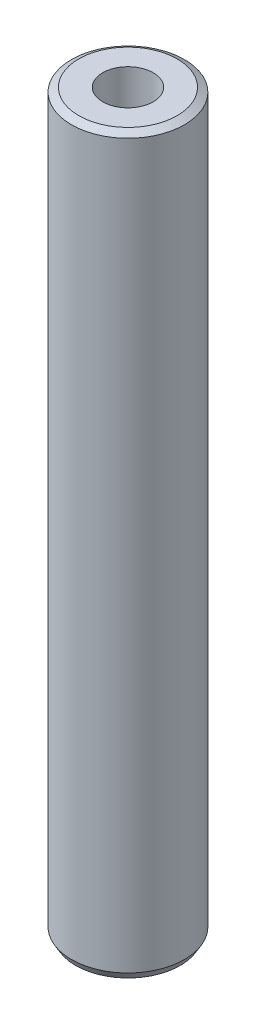
ISO-10303-21;
HEADER;
FILE_DESCRIPTION(('STEP AP214'),'2;1');
FILE_NAME('part.step','',(''),(''),'','','');
FILE_SCHEMA(('AUTOMOTIVE_DESIGN { 1 0 10303 214 1 1 1 1 }'));
ENDSEC;
DATA;
#1=APPLICATION_CONTEXT('core data for automotive mechanical design processes');
#2=APPLICATION_PROTOCOL_DEFINITION('international standard','automotive_design',2000,#1);
#3=PRODUCT_CONTEXT('',#1,'mechanical');
#4=PRODUCT('Part','Part','',(#3));
#5=PRODUCT_RELATED_PRODUCT_CATEGORY('part','',(#4));
#6=PRODUCT_DEFINITION_FORMATION('','',#4);
#7=PRODUCT_DEFINITION_CONTEXT('part definition',#1,'design');
#8=PRODUCT_DEFINITION('design','',#6,#7);
#9=PRODUCT_DEFINITION_SHAPE('','',#8);
#10=(LENGTH_UNIT() NAMED_UNIT(*) SI_UNIT(.MILLI.,.METRE.));
#11=(NAMED_UNIT(*) PLANE_ANGLE_UNIT() SI_UNIT($,.RADIAN.));
#12=(NAMED_UNIT(*) SI_UNIT($,.STERADIAN.) SOLID_ANGLE_UNIT());
#13=UNCERTAINTY_MEASURE_WITH_UNIT(LENGTH_MEASURE(1.E-05),#10,'distance_accuracy_value','');
#14=(GEOMETRIC_REPRESENTATION_CONTEXT(3) GLOBAL_UNCERTAINTY_ASSIGNED_CONTEXT((#13)) GLOBAL_UNIT_ASSIGNED_CONTEXT((#10,
#11,#12)) REPRESENTATION_CONTEXT('',''));
#15=CARTESIAN_POINT('',(0.,0.,0.));
#16=DIRECTION('',(0.,0.,1.));
#17=DIRECTION('',(1.,0.,0.));
#18=AXIS2_PLACEMENT_3D('',#15,#16,#17);
#19=CARTESIAN_POINT('',(0.,519.770944624068,0.));
#20=DIRECTION('',(0.,-1.,0.));
#21=DIRECTION('',(0.,0.,-1.));
#22=AXIS2_PLACEMENT_3D('',#19,#20,#21);
#23=CYLINDRICAL_SURFACE('',#22,40.);
#24=CARTESIAN_POINT('',(0.,516.782047485106,0.));
#25=DIRECTION('',(0.,1.,0.));
#26=DIRECTION('',(0.,0.,1.));
#27=AXIS2_PLACEMENT_3D('',#24,#25,#26);
#28=CIRCLE('',#27,40.);
#29=CARTESIAN_POINT('',(0.,516.782047485106,40.));
#30=VERTEX_POINT('',#29);
#31=EDGE_CURVE('E50',#30,#30,#28,.F.);
#32=ORIENTED_EDGE('',*,*,#31,.T.);
#33=EDGE_LOOP('',(#32));
#34=FACE_BOUND('',#33,.T.);
#35=CARTESIAN_POINT('',(0.,5.17692170328021,0.));
#36=DIRECTION('',(0.,1.,0.));
#37=DIRECTION('',(0.,0.,1.));
#38=AXIS2_PLACEMENT_3D('',#35,#36,#37);
#39=CIRCLE('',#38,40.);
#40=CARTESIAN_POINT('',(0.,5.17692170328021,40.));
#41=VERTEX_POINT('',#40);
#42=EDGE_CURVE('E51',#41,#41,#39,.T.);
#43=ORIENTED_EDGE('',*,*,#42,.T.);
#44=EDGE_LOOP('',(#43));
#45=FACE_BOUND('',#44,.T.);
#46=ADVANCED_FACE('F39',(#34,#45),#23,.T.);
#47=CARTESIAN_POINT('',(0.,519.770944624068,0.));
#48=DIRECTION('',(0.,1.,0.));
#49=DIRECTION('',(0.,0.,1.));
#50=AXIS2_PLACEMENT_3D('',#47,#48,#49);
#51=PLANE('',#50);
#52=CARTESIAN_POINT('',(0.,519.770944624068,0.));
#53=DIRECTION('',(0.,1.,0.));
#54=DIRECTION('',(0.,0.,1.));
#55=AXIS2_PLACEMENT_3D('',#52,#53,#54);
#56=CIRCLE('',#55,34.8230782967197);
#57=CARTESIAN_POINT('',(0.,519.770944624068,34.8230782967197));
#58=VERTEX_POINT('',#57);
#59=EDGE_CURVE('E54',#58,#58,#56,.T.);
#60=ORIENTED_EDGE('',*,*,#59,.T.);
#61=EDGE_LOOP('',(#60));
#62=FACE_BOUND('',#61,.T.);
#63=CARTESIAN_POINT('',(0.,519.770944624068,0.));
#64=DIRECTION('',(0.,1.,0.));
#65=DIRECTION('',(0.,0.,1.));
#66=AXIS2_PLACEMENT_3D('',#63,#64,#65);
#67=CIRCLE('',#66,17.8575470488768);
#68=CARTESIAN_POINT('',(0.,519.770944624068,17.8575470488768));
#69=VERTEX_POINT('',#68);
#70=EDGE_CURVE('E58',#69,#69,#67,.T.);
#71=ORIENTED_EDGE('',*,*,#70,.F.);
#72=EDGE_LOOP('',(#71));
#73=FACE_BOUND('',#72,.T.);
#74=ADVANCED_FACE('F69',(#62,#73),#51,.T.);
#75=CARTESIAN_POINT('',(0.,0.,0.));
#76=DIRECTION('',(0.,1.,0.));
#77=DIRECTION('',(0.,0.,1.));
#78=AXIS2_PLACEMENT_3D('',#75,#76,#77);
#79=PLANE('',#78);
#80=CARTESIAN_POINT('',(0.,0.,0.));
#81=DIRECTION('',(0.,1.,0.));
#82=DIRECTION('',(0.,0.,1.));
#83=AXIS2_PLACEMENT_3D('',#80,#81,#82);
#84=CIRCLE('',#83,37.0111028610375);
#85=CARTESIAN_POINT('',(0.,0.,37.0111028610375));
#86=VERTEX_POINT('',#85);
#87=EDGE_CURVE('E10',#86,#86,#84,.F.);
#88=ORIENTED_EDGE('',*,*,#87,.T.);
#89=EDGE_LOOP('',(#88));
#90=FACE_BOUND('',#89,.T.);
#91=CARTESIAN_POINT('',(0.,0.,0.));
#92=DIRECTION('',(0.,1.,0.));
#93=DIRECTION('',(0.,0.,1.));
#94=AXIS2_PLACEMENT_3D('',#91,#92,#93);
#95=CIRCLE('',#94,17.8575470488768);
#96=CARTESIAN_POINT('',(0.,0.,17.8575470488768));
#97=VERTEX_POINT('',#96);
#98=EDGE_CURVE('E63',#97,#97,#95,.T.);
#99=ORIENTED_EDGE('',*,*,#98,.T.);
#100=EDGE_LOOP('',(#99));
#101=FACE_BOUND('',#100,.T.);
#102=ADVANCED_FACE('F75',(#90,#101),#79,.F.);
#103=CARTESIAN_POINT('',(0.,519.770944624068,0.));
#104=DIRECTION('',(0.,-1.,0.));
#105=DIRECTION('',(0.,0.,-1.));
#106=AXIS2_PLACEMENT_3D('',#103,#104,#105);
#107=CYLINDRICAL_SURFACE('',#106,17.8575470488768);
#108=ORIENTED_EDGE('',*,*,#70,.T.);
#109=EDGE_LOOP('',(#108));
#110=FACE_BOUND('',#109,.T.);
#111=ORIENTED_EDGE('',*,*,#98,.F.);
#112=EDGE_LOOP('',(#111));
#113=FACE_BOUND('',#112,.T.);
#114=ADVANCED_FACE('F70',(#110,#113),#107,.F.);
#115=CARTESIAN_POINT('',(0.,519.770944624068,0.));
#116=DIRECTION('',(0.,-1.,0.));
#117=DIRECTION('',(0.,0.,-1.));
#118=AXIS2_PLACEMENT_3D('',#115,#116,#117);
#119=CONICAL_SURFACE('',#118,34.8230782967197,1.04719755119659);
#120=ORIENTED_EDGE('',*,*,#31,.F.);
#121=EDGE_LOOP('',(#120));
#122=FACE_BOUND('',#121,.T.);
#123=ORIENTED_EDGE('',*,*,#59,.F.);
#124=EDGE_LOOP('',(#123));
#125=FACE_BOUND('',#124,.T.);
#126=ADVANCED_FACE('F81',(#122,#125),#119,.T.);
#127=CARTESIAN_POINT('',(0.,5.17692170328021,0.));
#128=DIRECTION('',(0.,1.,0.));
#129=DIRECTION('',(0.,0.,1.));
#130=AXIS2_PLACEMENT_3D('',#127,#128,#129);
#131=CONICAL_SURFACE('',#130,40.,0.523598775598301);
#132=ORIENTED_EDGE('',*,*,#87,.F.);
#133=EDGE_LOOP('',(#132));
#134=FACE_BOUND('',#133,.T.);
#135=ORIENTED_EDGE('',*,*,#42,.F.);
#136=EDGE_LOOP('',(#135));
#137=FACE_BOUND('',#136,.T.);
#138=ADVANCED_FACE('F45',(#134,#137),#131,.T.);
#139=CLOSED_SHELL('',(#46,#74,#102,#114,#126,#138));
#140=MANIFOLD_SOLID_BREP('B2',#139);
#141=ADVANCED_BREP_SHAPE_REPRESENTATION('',(#18,#140),#14);
#142=SHAPE_DEFINITION_REPRESENTATION(#9,#141);
ENDSEC;
END-ISO-10303-21;
